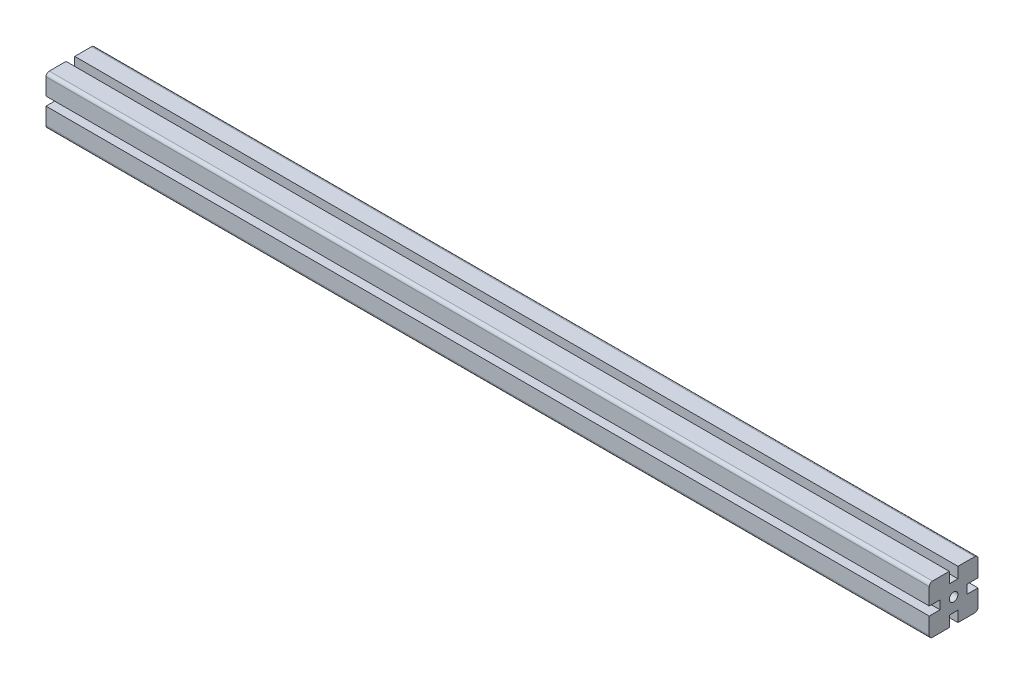
ISO-10303-21;
HEADER;
FILE_DESCRIPTION(('STEP AP214'),'2;1');
FILE_NAME('part.step','',(''),(''),'','','');
FILE_SCHEMA(('AUTOMOTIVE_DESIGN { 1 0 10303 214 1 1 1 1 }'));
ENDSEC;
DATA;
#1=APPLICATION_CONTEXT('core data for automotive mechanical design processes');
#2=APPLICATION_PROTOCOL_DEFINITION('international standard','automotive_design',2000,#1);
#3=PRODUCT_CONTEXT('',#1,'mechanical');
#4=PRODUCT('Part','Part','',(#3));
#5=PRODUCT_RELATED_PRODUCT_CATEGORY('part','',(#4));
#6=PRODUCT_DEFINITION_FORMATION('','',#4);
#7=PRODUCT_DEFINITION_CONTEXT('part definition',#1,'design');
#8=PRODUCT_DEFINITION('design','',#6,#7);
#9=PRODUCT_DEFINITION_SHAPE('','',#8);
#10=(LENGTH_UNIT() NAMED_UNIT(*) SI_UNIT(.MILLI.,.METRE.));
#11=(NAMED_UNIT(*) PLANE_ANGLE_UNIT() SI_UNIT($,.RADIAN.));
#12=(NAMED_UNIT(*) SI_UNIT($,.STERADIAN.) SOLID_ANGLE_UNIT());
#13=UNCERTAINTY_MEASURE_WITH_UNIT(LENGTH_MEASURE(1.E-05),#10,'distance_accuracy_value','');
#14=(GEOMETRIC_REPRESENTATION_CONTEXT(3) GLOBAL_UNCERTAINTY_ASSIGNED_CONTEXT((#13)) GLOBAL_UNIT_ASSIGNED_CONTEXT((#10,
#11,#12)) REPRESENTATION_CONTEXT('',''));
#15=CARTESIAN_POINT('',(0.,0.,0.));
#16=DIRECTION('',(0.,0.,1.));
#17=DIRECTION('',(1.,0.,0.));
#18=AXIS2_PLACEMENT_3D('',#15,#16,#17);
#19=CARTESIAN_POINT('',(185.,-22.5,-22.5));
#20=DIRECTION('',(0.,0.,-1.));
#21=DIRECTION('',(0.,1.,0.));
#22=AXIS2_PLACEMENT_3D('',#19,#20,#21);
#23=PLANE('',#22);
#24=DIRECTION('',(0.,1.,0.));
#25=VECTOR('',#24,1.);
#26=CARTESIAN_POINT('',(1000.,-22.5,-22.5));
#27=LINE('',#26,#25);
#28=CARTESIAN_POINT('',(1000.,-19.5,-22.5));
#29=VERTEX_POINT('',#28);
#30=CARTESIAN_POINT('',(1000.,-4.,-22.5));
#31=VERTEX_POINT('',#30);
#32=EDGE_CURVE('E274',#29,#31,#27,.T.);
#33=ORIENTED_EDGE('',*,*,#32,.F.);
#34=DIRECTION('',(1.,0.,0.));
#35=VECTOR('',#34,1.);
#36=CARTESIAN_POINT('',(185.,-19.5,-22.5));
#37=LINE('',#36,#35);
#38=CARTESIAN_POINT('',(185.,-19.5,-22.5));
#39=VERTEX_POINT('',#38);
#40=EDGE_CURVE('E205',#29,#39,#37,.F.);
#41=ORIENTED_EDGE('',*,*,#40,.T.);
#42=DIRECTION('',(0.,1.,0.));
#43=VECTOR('',#42,1.);
#44=CARTESIAN_POINT('',(185.,-22.5,-22.5));
#45=LINE('',#44,#43);
#46=CARTESIAN_POINT('',(185.,-4.,-22.5));
#47=VERTEX_POINT('',#46);
#48=EDGE_CURVE('E199',#39,#47,#45,.T.);
#49=ORIENTED_EDGE('',*,*,#48,.T.);
#50=DIRECTION('',(1.,0.,0.));
#51=VECTOR('',#50,1.);
#52=CARTESIAN_POINT('',(185.,-4.,-22.5));
#53=LINE('',#52,#51);
#54=EDGE_CURVE('E202',#47,#31,#53,.T.);
#55=ORIENTED_EDGE('',*,*,#54,.T.);
#56=EDGE_LOOP('',(#33,#41,#49,#55));
#57=FACE_BOUND('',#56,.T.);
#58=ADVANCED_FACE('F37',(#57),#23,.T.);
#59=CARTESIAN_POINT('',(185.,-22.5,-4.));
#60=DIRECTION('',(0.,-1.,0.));
#61=DIRECTION('',(0.,0.,-1.));
#62=AXIS2_PLACEMENT_3D('',#59,#60,#61);
#63=PLANE('',#62);
#64=DIRECTION('',(0.,0.,-1.));
#65=VECTOR('',#64,1.);
#66=CARTESIAN_POINT('',(185.,-22.5,-4.));
#67=LINE('',#66,#65);
#68=CARTESIAN_POINT('',(185.,-22.5,-4.));
#69=VERTEX_POINT('',#68);
#70=CARTESIAN_POINT('',(185.,-22.5,-19.5));
#71=VERTEX_POINT('',#70);
#72=EDGE_CURVE('E217',#69,#71,#67,.T.);
#73=ORIENTED_EDGE('',*,*,#72,.T.);
#74=DIRECTION('',(1.,0.,0.));
#75=VECTOR('',#74,1.);
#76=CARTESIAN_POINT('',(185.,-22.5,-19.5));
#77=LINE('',#76,#75);
#78=CARTESIAN_POINT('',(1000.,-22.5,-19.5));
#79=VERTEX_POINT('',#78);
#80=EDGE_CURVE('E330',#71,#79,#77,.T.);
#81=ORIENTED_EDGE('',*,*,#80,.T.);
#82=DIRECTION('',(0.,0.,-1.));
#83=VECTOR('',#82,1.);
#84=CARTESIAN_POINT('',(1000.,-22.5,-4.));
#85=LINE('',#84,#83);
#86=CARTESIAN_POINT('',(1000.,-22.5,-4.));
#87=VERTEX_POINT('',#86);
#88=EDGE_CURVE('E209',#87,#79,#85,.T.);
#89=ORIENTED_EDGE('',*,*,#88,.F.);
#90=DIRECTION('',(1.,0.,0.));
#91=VECTOR('',#90,1.);
#92=CARTESIAN_POINT('',(185.,-22.5,-4.));
#93=LINE('',#92,#91);
#94=EDGE_CURVE('E328',#69,#87,#93,.T.);
#95=ORIENTED_EDGE('',*,*,#94,.F.);
#96=EDGE_LOOP('',(#73,#81,#89,#95));
#97=FACE_BOUND('',#96,.T.);
#98=ADVANCED_FACE('F450',(#97),#63,.T.);
#99=CARTESIAN_POINT('',(185.,-12.5,-4.));
#100=DIRECTION('',(0.,0.,1.));
#101=DIRECTION('',(1.,0.,0.));
#102=AXIS2_PLACEMENT_3D('',#99,#100,#101);
#103=PLANE('',#102);
#104=DIRECTION('',(0.,-1.,0.));
#105=VECTOR('',#104,1.);
#106=CARTESIAN_POINT('',(1000.,-12.5,-4.));
#107=LINE('',#106,#105);
#108=CARTESIAN_POINT('',(1000.,-12.5,-4.));
#109=VERTEX_POINT('',#108);
#110=EDGE_CURVE('E323',#109,#87,#107,.T.);
#111=ORIENTED_EDGE('',*,*,#110,.F.);
#112=DIRECTION('',(1.,0.,0.));
#113=VECTOR('',#112,1.);
#114=CARTESIAN_POINT('',(185.,-12.5,-4.));
#115=LINE('',#114,#113);
#116=CARTESIAN_POINT('',(185.,-12.5,-4.));
#117=VERTEX_POINT('',#116);
#118=EDGE_CURVE('E331',#117,#109,#115,.T.);
#119=ORIENTED_EDGE('',*,*,#118,.F.);
#120=DIRECTION('',(0.,-1.,0.));
#121=VECTOR('',#120,1.);
#122=CARTESIAN_POINT('',(185.,-12.5,-4.));
#123=LINE('',#122,#121);
#124=EDGE_CURVE('E269',#117,#69,#123,.T.);
#125=ORIENTED_EDGE('',*,*,#124,.T.);
#126=ORIENTED_EDGE('',*,*,#94,.T.);
#127=EDGE_LOOP('',(#111,#119,#125,#126));
#128=FACE_BOUND('',#127,.T.);
#129=ADVANCED_FACE('F447',(#128),#103,.T.);
#130=CARTESIAN_POINT('',(185.,-12.5,4.));
#131=DIRECTION('',(0.,-1.,0.));
#132=DIRECTION('',(0.,0.,-1.));
#133=AXIS2_PLACEMENT_3D('',#130,#131,#132);
#134=PLANE('',#133);
#135=DIRECTION('',(0.,0.,-1.));
#136=VECTOR('',#135,1.);
#137=CARTESIAN_POINT('',(1000.,-12.5,4.));
#138=LINE('',#137,#136);
#139=CARTESIAN_POINT('',(1000.,-12.5,4.));
#140=VERTEX_POINT('',#139);
#141=EDGE_CURVE('E320',#140,#109,#138,.T.);
#142=ORIENTED_EDGE('',*,*,#141,.F.);
#143=DIRECTION('',(1.,0.,0.));
#144=VECTOR('',#143,1.);
#145=CARTESIAN_POINT('',(185.,-12.5,4.));
#146=LINE('',#145,#144);
#147=CARTESIAN_POINT('',(185.,-12.5,4.));
#148=VERTEX_POINT('',#147);
#149=EDGE_CURVE('E333',#148,#140,#146,.T.);
#150=ORIENTED_EDGE('',*,*,#149,.F.);
#151=DIRECTION('',(0.,0.,-1.));
#152=VECTOR('',#151,1.);
#153=CARTESIAN_POINT('',(185.,-12.5,4.));
#154=LINE('',#153,#152);
#155=EDGE_CURVE('E266',#148,#117,#154,.T.);
#156=ORIENTED_EDGE('',*,*,#155,.T.);
#157=ORIENTED_EDGE('',*,*,#118,.T.);
#158=EDGE_LOOP('',(#142,#150,#156,#157));
#159=FACE_BOUND('',#158,.T.);
#160=ADVANCED_FACE('F445',(#159),#134,.T.);
#161=CARTESIAN_POINT('',(185.,-22.5,4.));
#162=DIRECTION('',(0.,0.,-1.));
#163=DIRECTION('',(-1.,0.,0.));
#164=AXIS2_PLACEMENT_3D('',#161,#162,#163);
#165=PLANE('',#164);
#166=DIRECTION('',(0.,1.,0.));
#167=VECTOR('',#166,1.);
#168=CARTESIAN_POINT('',(1000.,-22.5,4.));
#169=LINE('',#168,#167);
#170=CARTESIAN_POINT('',(1000.,-22.5,4.));
#171=VERTEX_POINT('',#170);
#172=EDGE_CURVE('E317',#171,#140,#169,.T.);
#173=ORIENTED_EDGE('',*,*,#172,.F.);
#174=DIRECTION('',(1.,0.,0.));
#175=VECTOR('',#174,1.);
#176=CARTESIAN_POINT('',(185.,-22.5,4.));
#177=LINE('',#176,#175);
#178=CARTESIAN_POINT('',(185.,-22.5,4.));
#179=VERTEX_POINT('',#178);
#180=EDGE_CURVE('E335',#179,#171,#177,.T.);
#181=ORIENTED_EDGE('',*,*,#180,.F.);
#182=DIRECTION('',(0.,1.,0.));
#183=VECTOR('',#182,1.);
#184=CARTESIAN_POINT('',(185.,-22.5,4.));
#185=LINE('',#184,#183);
#186=EDGE_CURVE('E263',#179,#148,#185,.T.);
#187=ORIENTED_EDGE('',*,*,#186,.T.);
#188=ORIENTED_EDGE('',*,*,#149,.T.);
#189=EDGE_LOOP('',(#173,#181,#187,#188));
#190=FACE_BOUND('',#189,.T.);
#191=ADVANCED_FACE('F440',(#190),#165,.T.);
#192=CARTESIAN_POINT('',(185.,-22.5,22.5));
#193=DIRECTION('',(0.,-1.,0.));
#194=DIRECTION('',(0.,0.,-1.));
#195=AXIS2_PLACEMENT_3D('',#192,#193,#194);
#196=PLANE('',#195);
#197=DIRECTION('',(0.,0.,-1.));
#198=VECTOR('',#197,1.);
#199=CARTESIAN_POINT('',(1000.,-22.5,22.5));
#200=LINE('',#199,#198);
#201=CARTESIAN_POINT('',(1000.,-22.5,19.5));
#202=VERTEX_POINT('',#201);
#203=EDGE_CURVE('E315',#202,#171,#200,.T.);
#204=ORIENTED_EDGE('',*,*,#203,.F.);
#205=DIRECTION('',(1.,0.,0.));
#206=VECTOR('',#205,1.);
#207=CARTESIAN_POINT('',(185.,-22.5,19.5));
#208=LINE('',#207,#206);
#209=CARTESIAN_POINT('',(185.,-22.5,19.5));
#210=VERTEX_POINT('',#209);
#211=EDGE_CURVE('E386',#202,#210,#208,.F.);
#212=ORIENTED_EDGE('',*,*,#211,.T.);
#213=DIRECTION('',(0.,0.,-1.));
#214=VECTOR('',#213,1.);
#215=CARTESIAN_POINT('',(185.,-22.5,22.5));
#216=LINE('',#215,#214);
#217=EDGE_CURVE('E261',#210,#179,#216,.T.);
#218=ORIENTED_EDGE('',*,*,#217,.T.);
#219=ORIENTED_EDGE('',*,*,#180,.T.);
#220=EDGE_LOOP('',(#204,#212,#218,#219));
#221=FACE_BOUND('',#220,.T.);
#222=ADVANCED_FACE('F433',(#221),#196,.T.);
#223=CARTESIAN_POINT('',(185.,-4.,22.5));
#224=DIRECTION('',(0.,0.,1.));
#225=DIRECTION('',(0.,-1.,0.));
#226=AXIS2_PLACEMENT_3D('',#223,#224,#225);
#227=PLANE('',#226);
#228=DIRECTION('',(0.,-1.,0.));
#229=VECTOR('',#228,1.);
#230=CARTESIAN_POINT('',(185.,-4.,22.5));
#231=LINE('',#230,#229);
#232=CARTESIAN_POINT('',(185.,-4.,22.5));
#233=VERTEX_POINT('',#232);
#234=CARTESIAN_POINT('',(185.,-19.5,22.5));
#235=VERTEX_POINT('',#234);
#236=EDGE_CURVE('E258',#233,#235,#231,.T.);
#237=ORIENTED_EDGE('',*,*,#236,.T.);
#238=DIRECTION('',(1.,0.,0.));
#239=VECTOR('',#238,1.);
#240=CARTESIAN_POINT('',(185.,-19.5,22.5));
#241=LINE('',#240,#239);
#242=CARTESIAN_POINT('',(1000.,-19.5,22.5));
#243=VERTEX_POINT('',#242);
#244=EDGE_CURVE('E383',#235,#243,#241,.T.);
#245=ORIENTED_EDGE('',*,*,#244,.T.);
#246=DIRECTION('',(0.,-1.,0.));
#247=VECTOR('',#246,1.);
#248=CARTESIAN_POINT('',(1000.,-4.,22.5));
#249=LINE('',#248,#247);
#250=CARTESIAN_POINT('',(1000.,-4.,22.5));
#251=VERTEX_POINT('',#250);
#252=EDGE_CURVE('E312',#251,#243,#249,.T.);
#253=ORIENTED_EDGE('',*,*,#252,.F.);
#254=DIRECTION('',(1.,0.,0.));
#255=VECTOR('',#254,1.);
#256=CARTESIAN_POINT('',(185.,-4.,22.5));
#257=LINE('',#256,#255);
#258=EDGE_CURVE('E338',#233,#251,#257,.T.);
#259=ORIENTED_EDGE('',*,*,#258,.F.);
#260=EDGE_LOOP('',(#237,#245,#253,#259));
#261=FACE_BOUND('',#260,.T.);
#262=ADVANCED_FACE('F424',(#261),#227,.T.);
#263=CARTESIAN_POINT('',(185.,-4.,12.5));
#264=DIRECTION('',(0.,1.,0.));
#265=DIRECTION('',(0.,0.,1.));
#266=AXIS2_PLACEMENT_3D('',#263,#264,#265);
#267=PLANE('',#266);
#268=DIRECTION('',(0.,0.,1.));
#269=VECTOR('',#268,1.);
#270=CARTESIAN_POINT('',(1000.,-4.,12.5));
#271=LINE('',#270,#269);
#272=CARTESIAN_POINT('',(1000.,-4.,12.5));
#273=VERTEX_POINT('',#272);
#274=EDGE_CURVE('E309',#273,#251,#271,.T.);
#275=ORIENTED_EDGE('',*,*,#274,.F.);
#276=DIRECTION('',(1.,0.,0.));
#277=VECTOR('',#276,1.);
#278=CARTESIAN_POINT('',(185.,-4.,12.5));
#279=LINE('',#278,#277);
#280=CARTESIAN_POINT('',(185.,-4.,12.5));
#281=VERTEX_POINT('',#280);
#282=EDGE_CURVE('E340',#281,#273,#279,.T.);
#283=ORIENTED_EDGE('',*,*,#282,.F.);
#284=DIRECTION('',(0.,0.,1.));
#285=VECTOR('',#284,1.);
#286=CARTESIAN_POINT('',(185.,-4.,12.5));
#287=LINE('',#286,#285);
#288=EDGE_CURVE('E255',#281,#233,#287,.T.);
#289=ORIENTED_EDGE('',*,*,#288,.T.);
#290=ORIENTED_EDGE('',*,*,#258,.T.);
#291=EDGE_LOOP('',(#275,#283,#289,#290));
#292=FACE_BOUND('',#291,.T.);
#293=ADVANCED_FACE('F420',(#292),#267,.T.);
#294=CARTESIAN_POINT('',(185.,4.,12.5));
#295=DIRECTION('',(0.,0.,1.));
#296=DIRECTION('',(1.,0.,0.));
#297=AXIS2_PLACEMENT_3D('',#294,#295,#296);
#298=PLANE('',#297);
#299=DIRECTION('',(0.,-1.,0.));
#300=VECTOR('',#299,1.);
#301=CARTESIAN_POINT('',(1000.,4.,12.5));
#302=LINE('',#301,#300);
#303=CARTESIAN_POINT('',(1000.,4.,12.5));
#304=VERTEX_POINT('',#303);
#305=EDGE_CURVE('E306',#304,#273,#302,.T.);
#306=ORIENTED_EDGE('',*,*,#305,.F.);
#307=DIRECTION('',(1.,0.,0.));
#308=VECTOR('',#307,1.);
#309=CARTESIAN_POINT('',(185.,4.,12.5));
#310=LINE('',#309,#308);
#311=CARTESIAN_POINT('',(185.,4.,12.5));
#312=VERTEX_POINT('',#311);
#313=EDGE_CURVE('E342',#312,#304,#310,.T.);
#314=ORIENTED_EDGE('',*,*,#313,.F.);
#315=DIRECTION('',(0.,-1.,0.));
#316=VECTOR('',#315,1.);
#317=CARTESIAN_POINT('',(185.,4.,12.5));
#318=LINE('',#317,#316);
#319=EDGE_CURVE('E252',#312,#281,#318,.T.);
#320=ORIENTED_EDGE('',*,*,#319,.T.);
#321=ORIENTED_EDGE('',*,*,#282,.T.);
#322=EDGE_LOOP('',(#306,#314,#320,#321));
#323=FACE_BOUND('',#322,.T.);
#324=ADVANCED_FACE('F416',(#323),#298,.T.);
#325=CARTESIAN_POINT('',(185.,4.,22.5));
#326=DIRECTION('',(0.,-1.,0.));
#327=DIRECTION('',(0.,0.,-1.));
#328=AXIS2_PLACEMENT_3D('',#325,#326,#327);
#329=PLANE('',#328);
#330=DIRECTION('',(0.,0.,-1.));
#331=VECTOR('',#330,1.);
#332=CARTESIAN_POINT('',(1000.,4.,22.5));
#333=LINE('',#332,#331);
#334=CARTESIAN_POINT('',(1000.,4.,22.5));
#335=VERTEX_POINT('',#334);
#336=EDGE_CURVE('E303',#335,#304,#333,.T.);
#337=ORIENTED_EDGE('',*,*,#336,.F.);
#338=DIRECTION('',(1.,0.,0.));
#339=VECTOR('',#338,1.);
#340=CARTESIAN_POINT('',(185.,4.,22.5));
#341=LINE('',#340,#339);
#342=CARTESIAN_POINT('',(185.,4.,22.5));
#343=VERTEX_POINT('',#342);
#344=EDGE_CURVE('E344',#343,#335,#341,.T.);
#345=ORIENTED_EDGE('',*,*,#344,.F.);
#346=DIRECTION('',(0.,0.,-1.));
#347=VECTOR('',#346,1.);
#348=CARTESIAN_POINT('',(185.,4.,22.5));
#349=LINE('',#348,#347);
#350=EDGE_CURVE('E249',#343,#312,#349,.T.);
#351=ORIENTED_EDGE('',*,*,#350,.T.);
#352=ORIENTED_EDGE('',*,*,#313,.T.);
#353=EDGE_LOOP('',(#337,#345,#351,#352));
#354=FACE_BOUND('',#353,.T.);
#355=ADVANCED_FACE('F413',(#354),#329,.T.);
#356=CARTESIAN_POINT('',(185.,22.5,22.5));
#357=DIRECTION('',(0.,0.,1.));
#358=DIRECTION('',(0.,-1.,0.));
#359=AXIS2_PLACEMENT_3D('',#356,#357,#358);
#360=PLANE('',#359);
#361=DIRECTION('',(0.,-1.,0.));
#362=VECTOR('',#361,1.);
#363=CARTESIAN_POINT('',(1000.,22.5,22.5));
#364=LINE('',#363,#362);
#365=CARTESIAN_POINT('',(1000.,19.5,22.5));
#366=VERTEX_POINT('',#365);
#367=EDGE_CURVE('E301',#366,#335,#364,.T.);
#368=ORIENTED_EDGE('',*,*,#367,.F.);
#369=DIRECTION('',(1.,0.,0.));
#370=VECTOR('',#369,1.);
#371=CARTESIAN_POINT('',(185.,19.5,22.5));
#372=LINE('',#371,#370);
#373=CARTESIAN_POINT('',(185.,19.5,22.5));
#374=VERTEX_POINT('',#373);
#375=EDGE_CURVE('E11',#366,#374,#372,.F.);
#376=ORIENTED_EDGE('',*,*,#375,.T.);
#377=DIRECTION('',(0.,-1.,0.));
#378=VECTOR('',#377,1.);
#379=CARTESIAN_POINT('',(185.,22.5,22.5));
#380=LINE('',#379,#378);
#381=EDGE_CURVE('E247',#374,#343,#380,.T.);
#382=ORIENTED_EDGE('',*,*,#381,.T.);
#383=ORIENTED_EDGE('',*,*,#344,.T.);
#384=EDGE_LOOP('',(#368,#376,#382,#383));
#385=FACE_BOUND('',#384,.T.);
#386=ADVANCED_FACE('F408',(#385),#360,.T.);
#387=CARTESIAN_POINT('',(185.,22.5,4.));
#388=DIRECTION('',(0.,1.,0.));
#389=DIRECTION('',(0.,0.,1.));
#390=AXIS2_PLACEMENT_3D('',#387,#388,#389);
#391=PLANE('',#390);
#392=DIRECTION('',(0.,0.,1.));
#393=VECTOR('',#392,1.);
#394=CARTESIAN_POINT('',(185.,22.5,4.));
#395=LINE('',#394,#393);
#396=CARTESIAN_POINT('',(185.,22.5,4.));
#397=VERTEX_POINT('',#396);
#398=CARTESIAN_POINT('',(185.,22.5,19.5));
#399=VERTEX_POINT('',#398);
#400=EDGE_CURVE('E244',#397,#399,#395,.T.);
#401=ORIENTED_EDGE('',*,*,#400,.T.);
#402=DIRECTION('',(1.,0.,0.));
#403=VECTOR('',#402,1.);
#404=CARTESIAN_POINT('',(185.,22.5,19.5));
#405=LINE('',#404,#403);
#406=CARTESIAN_POINT('',(1000.,22.5,19.5));
#407=VERTEX_POINT('',#406);
#408=EDGE_CURVE('E45',#399,#407,#405,.T.);
#409=ORIENTED_EDGE('',*,*,#408,.T.);
#410=DIRECTION('',(0.,0.,1.));
#411=VECTOR('',#410,1.);
#412=CARTESIAN_POINT('',(1000.,22.5,4.));
#413=LINE('',#412,#411);
#414=CARTESIAN_POINT('',(1000.,22.5,4.));
#415=VERTEX_POINT('',#414);
#416=EDGE_CURVE('E298',#415,#407,#413,.T.);
#417=ORIENTED_EDGE('',*,*,#416,.F.);
#418=DIRECTION('',(1.,0.,0.));
#419=VECTOR('',#418,1.);
#420=CARTESIAN_POINT('',(185.,22.5,4.));
#421=LINE('',#420,#419);
#422=EDGE_CURVE('E347',#397,#415,#421,.T.);
#423=ORIENTED_EDGE('',*,*,#422,.F.);
#424=EDGE_LOOP('',(#401,#409,#417,#423));
#425=FACE_BOUND('',#424,.T.);
#426=ADVANCED_FACE('F391',(#425),#391,.T.);
#427=CARTESIAN_POINT('',(185.,12.5,4.));
#428=DIRECTION('',(0.,0.,-1.));
#429=DIRECTION('',(-1.,0.,0.));
#430=AXIS2_PLACEMENT_3D('',#427,#428,#429);
#431=PLANE('',#430);
#432=DIRECTION('',(0.,1.,0.));
#433=VECTOR('',#432,1.);
#434=CARTESIAN_POINT('',(1000.,12.5,4.));
#435=LINE('',#434,#433);
#436=CARTESIAN_POINT('',(1000.,12.5,4.));
#437=VERTEX_POINT('',#436);
#438=EDGE_CURVE('E295',#437,#415,#435,.T.);
#439=ORIENTED_EDGE('',*,*,#438,.F.);
#440=DIRECTION('',(1.,0.,0.));
#441=VECTOR('',#440,1.);
#442=CARTESIAN_POINT('',(185.,12.5,4.));
#443=LINE('',#442,#441);
#444=CARTESIAN_POINT('',(185.,12.5,4.));
#445=VERTEX_POINT('',#444);
#446=EDGE_CURVE('E349',#445,#437,#443,.T.);
#447=ORIENTED_EDGE('',*,*,#446,.F.);
#448=DIRECTION('',(0.,1.,0.));
#449=VECTOR('',#448,1.);
#450=CARTESIAN_POINT('',(185.,12.5,4.));
#451=LINE('',#450,#449);
#452=EDGE_CURVE('E241',#445,#397,#451,.T.);
#453=ORIENTED_EDGE('',*,*,#452,.T.);
#454=ORIENTED_EDGE('',*,*,#422,.T.);
#455=EDGE_LOOP('',(#439,#447,#453,#454));
#456=FACE_BOUND('',#455,.T.);
#457=ADVANCED_FACE('F401',(#456),#431,.T.);
#458=CARTESIAN_POINT('',(185.,12.5,-4.));
#459=DIRECTION('',(0.,1.,0.));
#460=DIRECTION('',(0.,0.,1.));
#461=AXIS2_PLACEMENT_3D('',#458,#459,#460);
#462=PLANE('',#461);
#463=DIRECTION('',(0.,0.,1.));
#464=VECTOR('',#463,1.);
#465=CARTESIAN_POINT('',(1000.,12.5,-4.));
#466=LINE('',#465,#464);
#467=CARTESIAN_POINT('',(1000.,12.5,-4.));
#468=VERTEX_POINT('',#467);
#469=EDGE_CURVE('E292',#468,#437,#466,.T.);
#470=ORIENTED_EDGE('',*,*,#469,.F.);
#471=DIRECTION('',(1.,0.,0.));
#472=VECTOR('',#471,1.);
#473=CARTESIAN_POINT('',(185.,12.5,-4.));
#474=LINE('',#473,#472);
#475=CARTESIAN_POINT('',(185.,12.5,-4.));
#476=VERTEX_POINT('',#475);
#477=EDGE_CURVE('E351',#476,#468,#474,.T.);
#478=ORIENTED_EDGE('',*,*,#477,.F.);
#479=DIRECTION('',(0.,0.,1.));
#480=VECTOR('',#479,1.);
#481=CARTESIAN_POINT('',(185.,12.5,-4.));
#482=LINE('',#481,#480);
#483=EDGE_CURVE('E238',#476,#445,#482,.T.);
#484=ORIENTED_EDGE('',*,*,#483,.T.);
#485=ORIENTED_EDGE('',*,*,#446,.T.);
#486=EDGE_LOOP('',(#470,#478,#484,#485));
#487=FACE_BOUND('',#486,.T.);
#488=ADVANCED_FACE('F493',(#487),#462,.T.);
#489=CARTESIAN_POINT('',(185.,22.5,-4.));
#490=DIRECTION('',(0.,0.,1.));
#491=DIRECTION('',(1.,0.,0.));
#492=AXIS2_PLACEMENT_3D('',#489,#490,#491);
#493=PLANE('',#492);
#494=DIRECTION('',(0.,-1.,0.));
#495=VECTOR('',#494,1.);
#496=CARTESIAN_POINT('',(1000.,22.5,-4.));
#497=LINE('',#496,#495);
#498=CARTESIAN_POINT('',(1000.,22.5,-4.));
#499=VERTEX_POINT('',#498);
#500=EDGE_CURVE('E289',#499,#468,#497,.T.);
#501=ORIENTED_EDGE('',*,*,#500,.F.);
#502=DIRECTION('',(1.,0.,0.));
#503=VECTOR('',#502,1.);
#504=CARTESIAN_POINT('',(185.,22.5,-4.));
#505=LINE('',#504,#503);
#506=CARTESIAN_POINT('',(185.,22.5,-4.));
#507=VERTEX_POINT('',#506);
#508=EDGE_CURVE('E353',#507,#499,#505,.T.);
#509=ORIENTED_EDGE('',*,*,#508,.F.);
#510=DIRECTION('',(0.,-1.,0.));
#511=VECTOR('',#510,1.);
#512=CARTESIAN_POINT('',(185.,22.5,-4.));
#513=LINE('',#512,#511);
#514=EDGE_CURVE('E235',#507,#476,#513,.T.);
#515=ORIENTED_EDGE('',*,*,#514,.T.);
#516=ORIENTED_EDGE('',*,*,#477,.T.);
#517=EDGE_LOOP('',(#501,#509,#515,#516));
#518=FACE_BOUND('',#517,.T.);
#519=ADVANCED_FACE('F490',(#518),#493,.T.);
#520=CARTESIAN_POINT('',(185.,22.5,-22.5));
#521=DIRECTION('',(0.,1.,0.));
#522=DIRECTION('',(0.,0.,1.));
#523=AXIS2_PLACEMENT_3D('',#520,#521,#522);
#524=PLANE('',#523);
#525=DIRECTION('',(0.,0.,1.));
#526=VECTOR('',#525,1.);
#527=CARTESIAN_POINT('',(1000.,22.5,-22.5));
#528=LINE('',#527,#526);
#529=CARTESIAN_POINT('',(1000.,22.5,-19.5));
#530=VERTEX_POINT('',#529);
#531=EDGE_CURVE('E287',#530,#499,#528,.T.);
#532=ORIENTED_EDGE('',*,*,#531,.F.);
#533=DIRECTION('',(1.,0.,0.));
#534=VECTOR('',#533,1.);
#535=CARTESIAN_POINT('',(185.,22.5,-19.5));
#536=LINE('',#535,#534);
#537=CARTESIAN_POINT('',(185.,22.5,-19.5));
#538=VERTEX_POINT('',#537);
#539=EDGE_CURVE('E60',#530,#538,#536,.F.);
#540=ORIENTED_EDGE('',*,*,#539,.T.);
#541=DIRECTION('',(0.,0.,1.));
#542=VECTOR('',#541,1.);
#543=CARTESIAN_POINT('',(185.,22.5,-22.5));
#544=LINE('',#543,#542);
#545=EDGE_CURVE('E233',#538,#507,#544,.T.);
#546=ORIENTED_EDGE('',*,*,#545,.T.);
#547=ORIENTED_EDGE('',*,*,#508,.T.);
#548=EDGE_LOOP('',(#532,#540,#546,#547));
#549=FACE_BOUND('',#548,.T.);
#550=ADVANCED_FACE('F486',(#549),#524,.T.);
#551=CARTESIAN_POINT('',(185.,4.,-22.5));
#552=DIRECTION('',(0.,0.,-1.));
#553=DIRECTION('',(0.,1.,0.));
#554=AXIS2_PLACEMENT_3D('',#551,#552,#553);
#555=PLANE('',#554);
#556=DIRECTION('',(0.,1.,0.));
#557=VECTOR('',#556,1.);
#558=CARTESIAN_POINT('',(185.,4.,-22.5));
#559=LINE('',#558,#557);
#560=CARTESIAN_POINT('',(185.,4.,-22.5));
#561=VERTEX_POINT('',#560);
#562=CARTESIAN_POINT('',(185.,19.5,-22.5));
#563=VERTEX_POINT('',#562);
#564=EDGE_CURVE('E231',#561,#563,#559,.T.);
#565=ORIENTED_EDGE('',*,*,#564,.T.);
#566=DIRECTION('',(1.,0.,0.));
#567=VECTOR('',#566,1.);
#568=CARTESIAN_POINT('',(185.,19.5,-22.5));
#569=LINE('',#568,#567);
#570=CARTESIAN_POINT('',(1000.,19.5,-22.5));
#571=VERTEX_POINT('',#570);
#572=EDGE_CURVE('E379',#563,#571,#569,.T.);
#573=ORIENTED_EDGE('',*,*,#572,.T.);
#574=DIRECTION('',(0.,1.,0.));
#575=VECTOR('',#574,1.);
#576=CARTESIAN_POINT('',(1000.,4.,-22.5));
#577=LINE('',#576,#575);
#578=CARTESIAN_POINT('',(1000.,4.,-22.5));
#579=VERTEX_POINT('',#578);
#580=EDGE_CURVE('E284',#579,#571,#577,.T.);
#581=ORIENTED_EDGE('',*,*,#580,.F.);
#582=DIRECTION('',(1.,0.,0.));
#583=VECTOR('',#582,1.);
#584=CARTESIAN_POINT('',(185.,4.,-22.5));
#585=LINE('',#584,#583);
#586=EDGE_CURVE('E356',#561,#579,#585,.T.);
#587=ORIENTED_EDGE('',*,*,#586,.F.);
#588=EDGE_LOOP('',(#565,#573,#581,#587));
#589=FACE_BOUND('',#588,.T.);
#590=ADVANCED_FACE('F482',(#589),#555,.T.);
#591=CARTESIAN_POINT('',(185.,4.,-12.5));
#592=DIRECTION('',(0.,-1.,0.));
#593=DIRECTION('',(0.,0.,-1.));
#594=AXIS2_PLACEMENT_3D('',#591,#592,#593);
#595=PLANE('',#594);
#596=DIRECTION('',(0.,0.,-1.));
#597=VECTOR('',#596,1.);
#598=CARTESIAN_POINT('',(1000.,4.,-12.5));
#599=LINE('',#598,#597);
#600=CARTESIAN_POINT('',(1000.,4.,-12.5));
#601=VERTEX_POINT('',#600);
#602=EDGE_CURVE('E281',#601,#579,#599,.T.);
#603=ORIENTED_EDGE('',*,*,#602,.F.);
#604=DIRECTION('',(1.,0.,0.));
#605=VECTOR('',#604,1.);
#606=CARTESIAN_POINT('',(185.,4.,-12.5));
#607=LINE('',#606,#605);
#608=CARTESIAN_POINT('',(185.,4.,-12.5));
#609=VERTEX_POINT('',#608);
#610=EDGE_CURVE('E358',#609,#601,#607,.T.);
#611=ORIENTED_EDGE('',*,*,#610,.F.);
#612=DIRECTION('',(0.,0.,-1.));
#613=VECTOR('',#612,1.);
#614=CARTESIAN_POINT('',(185.,4.,-12.5));
#615=LINE('',#614,#613);
#616=EDGE_CURVE('E225',#609,#561,#615,.T.);
#617=ORIENTED_EDGE('',*,*,#616,.T.);
#618=ORIENTED_EDGE('',*,*,#586,.T.);
#619=EDGE_LOOP('',(#603,#611,#617,#618));
#620=FACE_BOUND('',#619,.T.);
#621=ADVANCED_FACE('F478',(#620),#595,.T.);
#622=CARTESIAN_POINT('',(185.,-4.,-12.5));
#623=DIRECTION('',(0.,0.,-1.));
#624=DIRECTION('',(-1.,0.,0.));
#625=AXIS2_PLACEMENT_3D('',#622,#623,#624);
#626=PLANE('',#625);
#627=DIRECTION('',(0.,1.,0.));
#628=VECTOR('',#627,1.);
#629=CARTESIAN_POINT('',(1000.,-4.,-12.5));
#630=LINE('',#629,#628);
#631=CARTESIAN_POINT('',(1000.,-4.,-12.5));
#632=VERTEX_POINT('',#631);
#633=EDGE_CURVE('E278',#632,#601,#630,.T.);
#634=ORIENTED_EDGE('',*,*,#633,.F.);
#635=DIRECTION('',(1.,0.,0.));
#636=VECTOR('',#635,1.);
#637=CARTESIAN_POINT('',(185.,-4.,-12.5));
#638=LINE('',#637,#636);
#639=CARTESIAN_POINT('',(185.,-4.,-12.5));
#640=VERTEX_POINT('',#639);
#641=EDGE_CURVE('E216',#640,#632,#638,.T.);
#642=ORIENTED_EDGE('',*,*,#641,.F.);
#643=DIRECTION('',(0.,1.,0.));
#644=VECTOR('',#643,1.);
#645=CARTESIAN_POINT('',(185.,-4.,-12.5));
#646=LINE('',#645,#644);
#647=EDGE_CURVE('E223',#640,#609,#646,.T.);
#648=ORIENTED_EDGE('',*,*,#647,.T.);
#649=ORIENTED_EDGE('',*,*,#610,.T.);
#650=EDGE_LOOP('',(#634,#642,#648,#649));
#651=FACE_BOUND('',#650,.T.);
#652=ADVANCED_FACE('F475',(#651),#626,.T.);
#653=CARTESIAN_POINT('',(185.,-4.,-22.5));
#654=DIRECTION('',(0.,1.,0.));
#655=DIRECTION('',(0.,0.,1.));
#656=AXIS2_PLACEMENT_3D('',#653,#654,#655);
#657=PLANE('',#656);
#658=DIRECTION('',(0.,0.,1.));
#659=VECTOR('',#658,1.);
#660=CARTESIAN_POINT('',(1000.,-4.,-22.5));
#661=LINE('',#660,#659);
#662=EDGE_CURVE('E215',#31,#632,#661,.T.);
#663=ORIENTED_EDGE('',*,*,#662,.F.);
#664=ORIENTED_EDGE('',*,*,#54,.F.);
#665=DIRECTION('',(0.,0.,1.));
#666=VECTOR('',#665,1.);
#667=CARTESIAN_POINT('',(185.,-4.,-22.5));
#668=LINE('',#667,#666);
#669=EDGE_CURVE('E208',#47,#640,#668,.T.);
#670=ORIENTED_EDGE('',*,*,#669,.T.);
#671=ORIENTED_EDGE('',*,*,#641,.T.);
#672=EDGE_LOOP('',(#663,#664,#670,#671));
#673=FACE_BOUND('',#672,.T.);
#674=ADVANCED_FACE('F213',(#673),#657,.T.);
#675=CARTESIAN_POINT('',(185.,0.,0.));
#676=DIRECTION('',(1.,0.,0.));
#677=DIRECTION('',(0.,0.,-1.));
#678=AXIS2_PLACEMENT_3D('',#675,#676,#677);
#679=PLANE('',#678);
#680=CARTESIAN_POINT('',(185.,0.,0.));
#681=DIRECTION('',(1.,0.,0.));
#682=DIRECTION('',(0.,0.,1.));
#683=AXIS2_PLACEMENT_3D('',#680,#681,#682);
#684=CIRCLE('',#683,4.);
#685=CARTESIAN_POINT('',(185.,0.,4.));
#686=VERTEX_POINT('',#685);
#687=EDGE_CURVE('E276',#686,#686,#684,.T.);
#688=ORIENTED_EDGE('',*,*,#687,.T.);
#689=EDGE_LOOP('',(#688));
#690=FACE_BOUND('',#689,.T.);
#691=ORIENTED_EDGE('',*,*,#48,.F.);
#692=CARTESIAN_POINT('',(185.,-19.5,-19.5));
#693=DIRECTION('',(1.,0.,0.));
#694=DIRECTION('',(0.,0.,-1.));
#695=AXIS2_PLACEMENT_3D('',#692,#693,#694);
#696=CIRCLE('',#695,3.);
#697=EDGE_CURVE('E377',#39,#71,#696,.F.);
#698=ORIENTED_EDGE('',*,*,#697,.T.);
#699=ORIENTED_EDGE('',*,*,#72,.F.);
#700=ORIENTED_EDGE('',*,*,#124,.F.);
#701=ORIENTED_EDGE('',*,*,#155,.F.);
#702=ORIENTED_EDGE('',*,*,#186,.F.);
#703=ORIENTED_EDGE('',*,*,#217,.F.);
#704=CARTESIAN_POINT('',(185.,-19.5,19.5));
#705=DIRECTION('',(1.,0.,0.));
#706=DIRECTION('',(0.,0.,-1.));
#707=AXIS2_PLACEMENT_3D('',#704,#705,#706);
#708=CIRCLE('',#707,3.);
#709=EDGE_CURVE('E374',#210,#235,#708,.F.);
#710=ORIENTED_EDGE('',*,*,#709,.T.);
#711=ORIENTED_EDGE('',*,*,#236,.F.);
#712=ORIENTED_EDGE('',*,*,#288,.F.);
#713=ORIENTED_EDGE('',*,*,#319,.F.);
#714=ORIENTED_EDGE('',*,*,#350,.F.);
#715=ORIENTED_EDGE('',*,*,#381,.F.);
#716=CARTESIAN_POINT('',(185.,19.5,19.5));
#717=DIRECTION('',(1.,0.,0.));
#718=DIRECTION('',(0.,0.,-1.));
#719=AXIS2_PLACEMENT_3D('',#716,#717,#718);
#720=CIRCLE('',#719,3.);
#721=EDGE_CURVE('E372',#374,#399,#720,.F.);
#722=ORIENTED_EDGE('',*,*,#721,.T.);
#723=ORIENTED_EDGE('',*,*,#400,.F.);
#724=ORIENTED_EDGE('',*,*,#452,.F.);
#725=ORIENTED_EDGE('',*,*,#483,.F.);
#726=ORIENTED_EDGE('',*,*,#514,.F.);
#727=ORIENTED_EDGE('',*,*,#545,.F.);
#728=CARTESIAN_POINT('',(185.,19.5,-19.5));
#729=DIRECTION('',(1.,0.,0.));
#730=DIRECTION('',(0.,0.,-1.));
#731=AXIS2_PLACEMENT_3D('',#728,#729,#730);
#732=CIRCLE('',#731,3.);
#733=EDGE_CURVE('E52',#538,#563,#732,.F.);
#734=ORIENTED_EDGE('',*,*,#733,.T.);
#735=ORIENTED_EDGE('',*,*,#564,.F.);
#736=ORIENTED_EDGE('',*,*,#616,.F.);
#737=ORIENTED_EDGE('',*,*,#647,.F.);
#738=ORIENTED_EDGE('',*,*,#669,.F.);
#739=EDGE_LOOP('',(#691,#698,#699,#700,#701,#702,#703,#710,#711,#712,#713,#714,#715,#722,#723,
#724,#725,#726,#727,#734,#735,#736,#737,#738));
#740=FACE_BOUND('',#739,.T.);
#741=ADVANCED_FACE('F220',(#690,#740),#679,.F.);
#742=CARTESIAN_POINT('',(1000.,0.,0.));
#743=DIRECTION('',(1.,0.,0.));
#744=DIRECTION('',(0.,0.,-1.));
#745=AXIS2_PLACEMENT_3D('',#742,#743,#744);
#746=PLANE('',#745);
#747=CARTESIAN_POINT('',(1000.,0.,0.));
#748=DIRECTION('',(1.,0.,0.));
#749=DIRECTION('',(0.,0.,1.));
#750=AXIS2_PLACEMENT_3D('',#747,#748,#749);
#751=CIRCLE('',#750,4.);
#752=CARTESIAN_POINT('',(1000.,0.,4.));
#753=VERTEX_POINT('',#752);
#754=EDGE_CURVE('E529',#753,#753,#751,.T.);
#755=ORIENTED_EDGE('',*,*,#754,.F.);
#756=EDGE_LOOP('',(#755));
#757=FACE_BOUND('',#756,.T.);
#758=ORIENTED_EDGE('',*,*,#88,.T.);
#759=CARTESIAN_POINT('',(1000.,-19.5,-19.5));
#760=DIRECTION('',(1.,0.,0.));
#761=DIRECTION('',(0.,0.,-1.));
#762=AXIS2_PLACEMENT_3D('',#759,#760,#761);
#763=CIRCLE('',#762,3.);
#764=EDGE_CURVE('E369',#79,#29,#763,.T.);
#765=ORIENTED_EDGE('',*,*,#764,.T.);
#766=ORIENTED_EDGE('',*,*,#32,.T.);
#767=ORIENTED_EDGE('',*,*,#662,.T.);
#768=ORIENTED_EDGE('',*,*,#633,.T.);
#769=ORIENTED_EDGE('',*,*,#602,.T.);
#770=ORIENTED_EDGE('',*,*,#580,.T.);
#771=CARTESIAN_POINT('',(1000.,19.5,-19.5));
#772=DIRECTION('',(1.,0.,0.));
#773=DIRECTION('',(0.,0.,-1.));
#774=AXIS2_PLACEMENT_3D('',#771,#772,#773);
#775=CIRCLE('',#774,3.);
#776=EDGE_CURVE('E367',#571,#530,#775,.T.);
#777=ORIENTED_EDGE('',*,*,#776,.T.);
#778=ORIENTED_EDGE('',*,*,#531,.T.);
#779=ORIENTED_EDGE('',*,*,#500,.T.);
#780=ORIENTED_EDGE('',*,*,#469,.T.);
#781=ORIENTED_EDGE('',*,*,#438,.T.);
#782=ORIENTED_EDGE('',*,*,#416,.T.);
#783=CARTESIAN_POINT('',(1000.,19.5,19.5));
#784=DIRECTION('',(1.,0.,0.));
#785=DIRECTION('',(0.,0.,-1.));
#786=AXIS2_PLACEMENT_3D('',#783,#784,#785);
#787=CIRCLE('',#786,3.);
#788=EDGE_CURVE('E363',#407,#366,#787,.T.);
#789=ORIENTED_EDGE('',*,*,#788,.T.);
#790=ORIENTED_EDGE('',*,*,#367,.T.);
#791=ORIENTED_EDGE('',*,*,#336,.T.);
#792=ORIENTED_EDGE('',*,*,#305,.T.);
#793=ORIENTED_EDGE('',*,*,#274,.T.);
#794=ORIENTED_EDGE('',*,*,#252,.T.);
#795=CARTESIAN_POINT('',(1000.,-19.5,19.5));
#796=DIRECTION('',(1.,0.,0.));
#797=DIRECTION('',(0.,0.,-1.));
#798=AXIS2_PLACEMENT_3D('',#795,#796,#797);
#799=CIRCLE('',#798,3.);
#800=EDGE_CURVE('E365',#243,#202,#799,.T.);
#801=ORIENTED_EDGE('',*,*,#800,.T.);
#802=ORIENTED_EDGE('',*,*,#203,.T.);
#803=ORIENTED_EDGE('',*,*,#172,.T.);
#804=ORIENTED_EDGE('',*,*,#141,.T.);
#805=ORIENTED_EDGE('',*,*,#110,.T.);
#806=EDGE_LOOP('',(#758,#765,#766,#767,#768,#769,#770,#777,#778,#779,#780,#781,#782,#789,#790,
#791,#792,#793,#794,#801,#802,#803,#804,#805));
#807=FACE_BOUND('',#806,.T.);
#808=ADVANCED_FACE('F396',(#757,#807),#746,.T.);
#809=CARTESIAN_POINT('',(185.,0.,0.));
#810=DIRECTION('',(1.,0.,0.));
#811=DIRECTION('',(0.,0.,-1.));
#812=AXIS2_PLACEMENT_3D('',#809,#810,#811);
#813=CYLINDRICAL_SURFACE('',#812,4.);
#814=ORIENTED_EDGE('',*,*,#687,.F.);
#815=EDGE_LOOP('',(#814));
#816=FACE_BOUND('',#815,.T.);
#817=ORIENTED_EDGE('',*,*,#754,.T.);
#818=EDGE_LOOP('',(#817));
#819=FACE_BOUND('',#818,.T.);
#820=ADVANCED_FACE('F456',(#816,#819),#813,.F.);
#821=CARTESIAN_POINT('',(185.,-19.5,-19.5));
#822=DIRECTION('',(1.,0.,0.));
#823=DIRECTION('',(0.,0.,-1.));
#824=AXIS2_PLACEMENT_3D('',#821,#822,#823);
#825=CYLINDRICAL_SURFACE('',#824,3.);
#826=ORIENTED_EDGE('',*,*,#697,.F.);
#827=ORIENTED_EDGE('',*,*,#40,.F.);
#828=ORIENTED_EDGE('',*,*,#764,.F.);
#829=ORIENTED_EDGE('',*,*,#80,.F.);
#830=EDGE_LOOP('',(#826,#827,#828,#829));
#831=FACE_BOUND('',#830,.T.);
#832=ADVANCED_FACE('F453',(#831),#825,.T.);
#833=CARTESIAN_POINT('',(185.,19.5,-19.5));
#834=DIRECTION('',(1.,0.,0.));
#835=DIRECTION('',(0.,0.,-1.));
#836=AXIS2_PLACEMENT_3D('',#833,#834,#835);
#837=CYLINDRICAL_SURFACE('',#836,3.);
#838=ORIENTED_EDGE('',*,*,#733,.F.);
#839=ORIENTED_EDGE('',*,*,#539,.F.);
#840=ORIENTED_EDGE('',*,*,#776,.F.);
#841=ORIENTED_EDGE('',*,*,#572,.F.);
#842=EDGE_LOOP('',(#838,#839,#840,#841));
#843=FACE_BOUND('',#842,.T.);
#844=ADVANCED_FACE('F455',(#843),#837,.T.);
#845=CARTESIAN_POINT('',(185.,-19.5,19.5));
#846=DIRECTION('',(1.,0.,0.));
#847=DIRECTION('',(0.,0.,-1.));
#848=AXIS2_PLACEMENT_3D('',#845,#846,#847);
#849=CYLINDRICAL_SURFACE('',#848,3.);
#850=ORIENTED_EDGE('',*,*,#709,.F.);
#851=ORIENTED_EDGE('',*,*,#211,.F.);
#852=ORIENTED_EDGE('',*,*,#800,.F.);
#853=ORIENTED_EDGE('',*,*,#244,.F.);
#854=EDGE_LOOP('',(#850,#851,#852,#853));
#855=FACE_BOUND('',#854,.T.);
#856=ADVANCED_FACE('F429',(#855),#849,.T.);
#857=CARTESIAN_POINT('',(185.,19.5,19.5));
#858=DIRECTION('',(1.,0.,0.));
#859=DIRECTION('',(0.,0.,-1.));
#860=AXIS2_PLACEMENT_3D('',#857,#858,#859);
#861=CYLINDRICAL_SURFACE('',#860,3.);
#862=ORIENTED_EDGE('',*,*,#721,.F.);
#863=ORIENTED_EDGE('',*,*,#375,.F.);
#864=ORIENTED_EDGE('',*,*,#788,.F.);
#865=ORIENTED_EDGE('',*,*,#408,.F.);
#866=EDGE_LOOP('',(#862,#863,#864,#865));
#867=FACE_BOUND('',#866,.T.);
#868=ADVANCED_FACE('F39',(#867),#861,.T.);
#869=CLOSED_SHELL('',(#58,#98,#129,#160,#191,#222,#262,#293,#324,#355,#386,#426,#457,#488,#519,
#550,#590,#621,#652,#674,#741,#808,#820,#832,#844,#856,#868));
#870=MANIFOLD_SOLID_BREP('B2',#869);
#871=ADVANCED_BREP_SHAPE_REPRESENTATION('',(#18,#870),#14);
#872=SHAPE_DEFINITION_REPRESENTATION(#9,#871);
ENDSEC;
END-ISO-10303-21;
